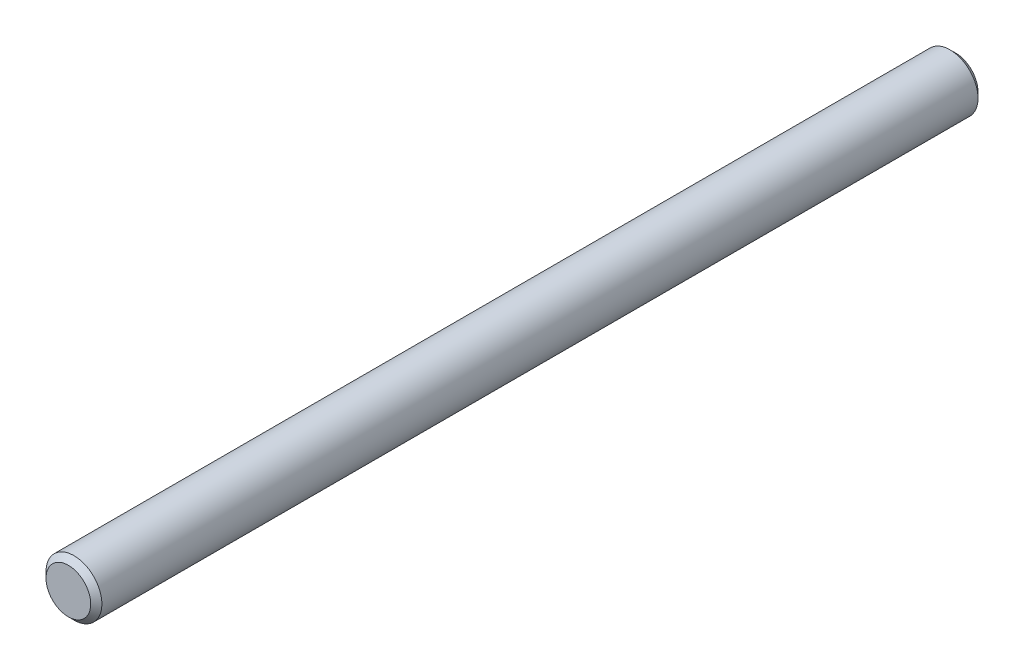
ISO-10303-21;
HEADER;
FILE_DESCRIPTION(('STEP AP214'),'2;1');
FILE_NAME('part.step','',(''),(''),'','','');
FILE_SCHEMA(('AUTOMOTIVE_DESIGN { 1 0 10303 214 1 1 1 1 }'));
ENDSEC;
DATA;
#1=APPLICATION_CONTEXT('core data for automotive mechanical design processes');
#2=APPLICATION_PROTOCOL_DEFINITION('international standard','automotive_design',2000,#1);
#3=PRODUCT_CONTEXT('',#1,'mechanical');
#4=PRODUCT('Part','Part','',(#3));
#5=PRODUCT_RELATED_PRODUCT_CATEGORY('part','',(#4));
#6=PRODUCT_DEFINITION_FORMATION('','',#4);
#7=PRODUCT_DEFINITION_CONTEXT('part definition',#1,'design');
#8=PRODUCT_DEFINITION('design','',#6,#7);
#9=PRODUCT_DEFINITION_SHAPE('','',#8);
#10=(LENGTH_UNIT() NAMED_UNIT(*) SI_UNIT(.MILLI.,.METRE.));
#11=(NAMED_UNIT(*) PLANE_ANGLE_UNIT() SI_UNIT($,.RADIAN.));
#12=(NAMED_UNIT(*) SI_UNIT($,.STERADIAN.) SOLID_ANGLE_UNIT());
#13=UNCERTAINTY_MEASURE_WITH_UNIT(LENGTH_MEASURE(1.E-05),#10,'distance_accuracy_value','');
#14=(GEOMETRIC_REPRESENTATION_CONTEXT(3) GLOBAL_UNCERTAINTY_ASSIGNED_CONTEXT((#13)) GLOBAL_UNIT_ASSIGNED_CONTEXT((#10,
#11,#12)) REPRESENTATION_CONTEXT('',''));
#15=CARTESIAN_POINT('',(0.,0.,0.));
#16=DIRECTION('',(0.,0.,1.));
#17=DIRECTION('',(1.,0.,0.));
#18=AXIS2_PLACEMENT_3D('',#15,#16,#17);
#19=CARTESIAN_POINT('',(0.,0.,75.6));
#20=DIRECTION('',(0.,0.,-1.));
#21=DIRECTION('',(-1.,0.,0.));
#22=AXIS2_PLACEMENT_3D('',#19,#20,#21);
#23=CYLINDRICAL_SURFACE('',#22,4.7625);
#24=CARTESIAN_POINT('',(0.,0.,-74.6475));
#25=DIRECTION('',(0.,0.,1.));
#26=DIRECTION('',(1.,0.,0.));
#27=AXIS2_PLACEMENT_3D('',#24,#25,#26);
#28=CIRCLE('',#27,4.7625);
#29=CARTESIAN_POINT('',(4.7625,0.,-74.6475));
#30=VERTEX_POINT('',#29);
#31=EDGE_CURVE('E45',#30,#30,#28,.T.);
#32=ORIENTED_EDGE('',*,*,#31,.T.);
#33=EDGE_LOOP('',(#32));
#34=FACE_BOUND('',#33,.T.);
#35=CARTESIAN_POINT('',(0.,0.,74.6475));
#36=DIRECTION('',(0.,0.,1.));
#37=DIRECTION('',(1.,0.,0.));
#38=AXIS2_PLACEMENT_3D('',#35,#36,#37);
#39=CIRCLE('',#38,4.7625);
#40=CARTESIAN_POINT('',(4.7625,0.,74.6475));
#41=VERTEX_POINT('',#40);
#42=EDGE_CURVE('E49',#41,#41,#39,.F.);
#43=ORIENTED_EDGE('',*,*,#42,.T.);
#44=EDGE_LOOP('',(#43));
#45=FACE_BOUND('',#44,.T.);
#46=ADVANCED_FACE('F34',(#34,#45),#23,.T.);
#47=CARTESIAN_POINT('',(0.,0.,75.6));
#48=DIRECTION('',(0.,0.,1.));
#49=DIRECTION('',(1.,0.,0.));
#50=AXIS2_PLACEMENT_3D('',#47,#48,#49);
#51=PLANE('',#50);
#52=CARTESIAN_POINT('',(0.,0.,75.6));
#53=DIRECTION('',(0.,0.,1.));
#54=DIRECTION('',(1.,0.,0.));
#55=AXIS2_PLACEMENT_3D('',#52,#53,#54);
#56=CIRCLE('',#55,3.81000000000002);
#57=CARTESIAN_POINT('',(3.81000000000002,0.,75.6));
#58=VERTEX_POINT('',#57);
#59=EDGE_CURVE('E10',#58,#58,#56,.T.);
#60=ORIENTED_EDGE('',*,*,#59,.T.);
#61=EDGE_LOOP('',(#60));
#62=FACE_BOUND('',#61,.T.);
#63=ADVANCED_FACE('F65',(#62),#51,.T.);
#64=CARTESIAN_POINT('',(0.,0.,-75.6));
#65=DIRECTION('',(0.,0.,1.));
#66=DIRECTION('',(1.,0.,0.));
#67=AXIS2_PLACEMENT_3D('',#64,#65,#66);
#68=PLANE('',#67);
#69=CARTESIAN_POINT('',(0.,0.,-75.6));
#70=DIRECTION('',(0.,0.,1.));
#71=DIRECTION('',(1.,0.,0.));
#72=AXIS2_PLACEMENT_3D('',#69,#70,#71);
#73=CIRCLE('',#72,3.81000000000001);
#74=CARTESIAN_POINT('',(3.81000000000001,0.,-75.6));
#75=VERTEX_POINT('',#74);
#76=EDGE_CURVE('E41',#75,#75,#73,.F.);
#77=ORIENTED_EDGE('',*,*,#76,.T.);
#78=EDGE_LOOP('',(#77));
#79=FACE_BOUND('',#78,.T.);
#80=ADVANCED_FACE('F62',(#79),#68,.F.);
#81=CARTESIAN_POINT('',(0.,0.,-74.6475));
#82=DIRECTION('',(0.,0.,1.));
#83=DIRECTION('',(1.,0.,0.));
#84=AXIS2_PLACEMENT_3D('',#81,#82,#83);
#85=CONICAL_SURFACE('',#84,4.7625,0.785398163397432);
#86=ORIENTED_EDGE('',*,*,#76,.F.);
#87=EDGE_LOOP('',(#86));
#88=FACE_BOUND('',#87,.T.);
#89=ORIENTED_EDGE('',*,*,#31,.F.);
#90=EDGE_LOOP('',(#89));
#91=FACE_BOUND('',#90,.T.);
#92=ADVANCED_FACE('F58',(#88,#91),#85,.T.);
#93=CARTESIAN_POINT('',(0.,0.,75.6));
#94=DIRECTION('',(0.,0.,-1.));
#95=DIRECTION('',(-1.,0.,0.));
#96=AXIS2_PLACEMENT_3D('',#93,#94,#95);
#97=CONICAL_SURFACE('',#96,3.81000000000002,0.785398163397447);
#98=ORIENTED_EDGE('',*,*,#42,.F.);
#99=EDGE_LOOP('',(#98));
#100=FACE_BOUND('',#99,.T.);
#101=ORIENTED_EDGE('',*,*,#59,.F.);
#102=EDGE_LOOP('',(#101));
#103=FACE_BOUND('',#102,.T.);
#104=ADVANCED_FACE('F36',(#100,#103),#97,.T.);
#105=CLOSED_SHELL('',(#46,#63,#80,#92,#104));
#106=MANIFOLD_SOLID_BREP('B2',#105);
#107=ADVANCED_BREP_SHAPE_REPRESENTATION('',(#18,#106),#14);
#108=SHAPE_DEFINITION_REPRESENTATION(#9,#107);
ENDSEC;
END-ISO-10303-21;
